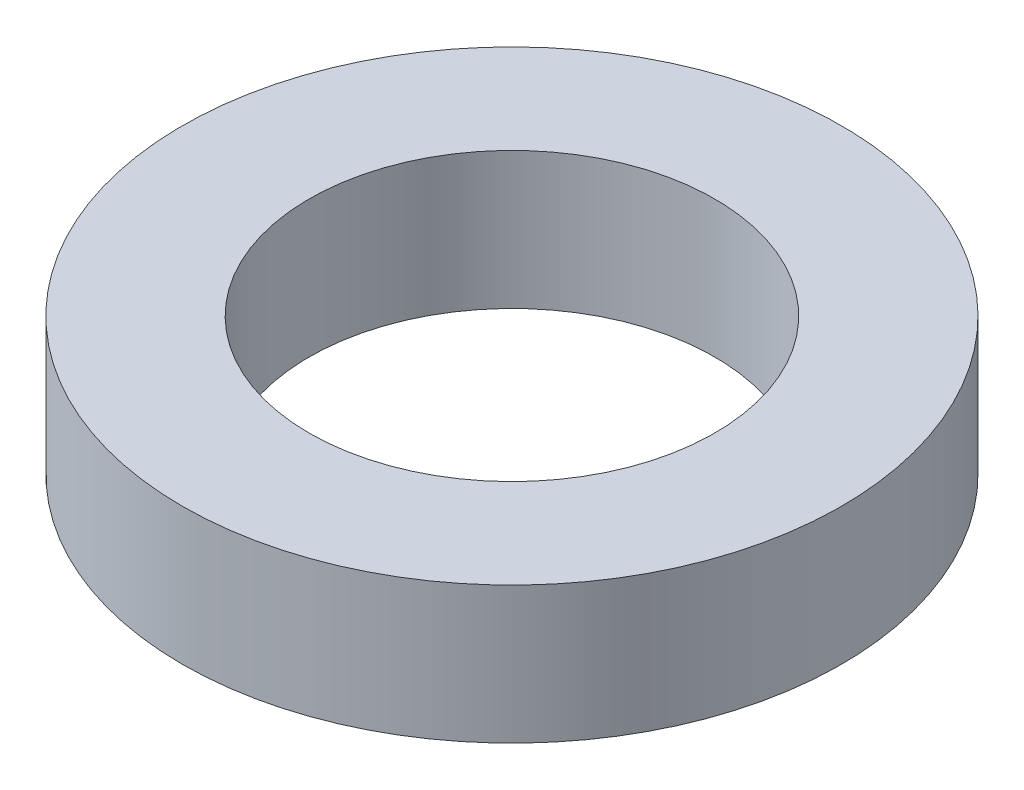
ISO-10303-21;
HEADER;
FILE_DESCRIPTION(('STEP AP214'),'2;1');
FILE_NAME('part.step','',(''),(''),'','','');
FILE_SCHEMA(('AUTOMOTIVE_DESIGN { 1 0 10303 214 1 1 1 1 }'));
ENDSEC;
DATA;
#1=APPLICATION_CONTEXT('core data for automotive mechanical design processes');
#2=APPLICATION_PROTOCOL_DEFINITION('international standard','automotive_design',2000,#1);
#3=PRODUCT_CONTEXT('',#1,'mechanical');
#4=PRODUCT('Part','Part','',(#3));
#5=PRODUCT_RELATED_PRODUCT_CATEGORY('part','',(#4));
#6=PRODUCT_DEFINITION_FORMATION('','',#4);
#7=PRODUCT_DEFINITION_CONTEXT('part definition',#1,'design');
#8=PRODUCT_DEFINITION('design','',#6,#7);
#9=PRODUCT_DEFINITION_SHAPE('','',#8);
#10=(LENGTH_UNIT() NAMED_UNIT(*) SI_UNIT(.MILLI.,.METRE.));
#11=(NAMED_UNIT(*) PLANE_ANGLE_UNIT() SI_UNIT($,.RADIAN.));
#12=(NAMED_UNIT(*) SI_UNIT($,.STERADIAN.) SOLID_ANGLE_UNIT());
#13=UNCERTAINTY_MEASURE_WITH_UNIT(LENGTH_MEASURE(1.E-05),#10,'distance_accuracy_value','');
#14=(GEOMETRIC_REPRESENTATION_CONTEXT(3) GLOBAL_UNCERTAINTY_ASSIGNED_CONTEXT((#13)) GLOBAL_UNIT_ASSIGNED_CONTEXT((#10,
#11,#12)) REPRESENTATION_CONTEXT('',''));
#15=CARTESIAN_POINT('',(0.,0.,0.));
#16=DIRECTION('',(0.,0.,1.));
#17=DIRECTION('',(1.,0.,0.));
#18=AXIS2_PLACEMENT_3D('',#15,#16,#17);
#19=CARTESIAN_POINT('',(0.,27.,0.));
#20=DIRECTION('',(0.,-1.,0.));
#21=DIRECTION('',(0.,0.,-1.));
#22=AXIS2_PLACEMENT_3D('',#19,#20,#21);
#23=CYLINDRICAL_SURFACE('',#22,65.);
#24=CARTESIAN_POINT('',(0.,27.,0.));
#25=DIRECTION('',(0.,1.,0.));
#26=DIRECTION('',(0.,0.,1.));
#27=AXIS2_PLACEMENT_3D('',#24,#25,#26);
#28=CIRCLE('',#27,65.);
#29=CARTESIAN_POINT('',(0.,27.,65.));
#30=VERTEX_POINT('',#29);
#31=EDGE_CURVE('E10',#30,#30,#28,.T.);
#32=ORIENTED_EDGE('',*,*,#31,.F.);
#33=EDGE_LOOP('',(#32));
#34=FACE_BOUND('',#33,.T.);
#35=CARTESIAN_POINT('',(0.,0.,0.));
#36=DIRECTION('',(0.,1.,0.));
#37=DIRECTION('',(0.,0.,1.));
#38=AXIS2_PLACEMENT_3D('',#35,#36,#37);
#39=CIRCLE('',#38,65.);
#40=CARTESIAN_POINT('',(0.,0.,65.));
#41=VERTEX_POINT('',#40);
#42=EDGE_CURVE('E37',#41,#41,#39,.T.);
#43=ORIENTED_EDGE('',*,*,#42,.T.);
#44=EDGE_LOOP('',(#43));
#45=FACE_BOUND('',#44,.T.);
#46=ADVANCED_FACE('F40',(#34,#45),#23,.T.);
#47=CARTESIAN_POINT('',(0.,27.,0.));
#48=DIRECTION('',(0.,1.,0.));
#49=DIRECTION('',(0.,0.,1.));
#50=AXIS2_PLACEMENT_3D('',#47,#48,#49);
#51=PLANE('',#50);
#52=CARTESIAN_POINT('',(0.,27.,0.));
#53=DIRECTION('',(0.,1.,0.));
#54=DIRECTION('',(0.,0.,1.));
#55=AXIS2_PLACEMENT_3D('',#52,#53,#54);
#56=CIRCLE('',#55,40.);
#57=CARTESIAN_POINT('',(0.,27.,40.));
#58=VERTEX_POINT('',#57);
#59=EDGE_CURVE('E50',#58,#58,#56,.T.);
#60=ORIENTED_EDGE('',*,*,#59,.F.);
#61=EDGE_LOOP('',(#60));
#62=FACE_BOUND('',#61,.T.);
#63=ORIENTED_EDGE('',*,*,#31,.T.);
#64=EDGE_LOOP('',(#63));
#65=FACE_BOUND('',#64,.T.);
#66=ADVANCED_FACE('F59',(#62,#65),#51,.T.);
#67=CARTESIAN_POINT('',(0.,0.,0.));
#68=DIRECTION('',(0.,1.,0.));
#69=DIRECTION('',(0.,0.,1.));
#70=AXIS2_PLACEMENT_3D('',#67,#68,#69);
#71=PLANE('',#70);
#72=CARTESIAN_POINT('',(0.,0.,0.));
#73=DIRECTION('',(0.,1.,0.));
#74=DIRECTION('',(0.,0.,1.));
#75=AXIS2_PLACEMENT_3D('',#72,#73,#74);
#76=CIRCLE('',#75,40.);
#77=CARTESIAN_POINT('',(0.,0.,40.));
#78=VERTEX_POINT('',#77);
#79=EDGE_CURVE('E47',#78,#78,#76,.T.);
#80=ORIENTED_EDGE('',*,*,#79,.T.);
#81=EDGE_LOOP('',(#80));
#82=FACE_BOUND('',#81,.T.);
#83=ORIENTED_EDGE('',*,*,#42,.F.);
#84=EDGE_LOOP('',(#83));
#85=FACE_BOUND('',#84,.T.);
#86=ADVANCED_FACE('F58',(#82,#85),#71,.F.);
#87=CARTESIAN_POINT('',(0.,27.,0.));
#88=DIRECTION('',(0.,-1.,0.));
#89=DIRECTION('',(0.,0.,-1.));
#90=AXIS2_PLACEMENT_3D('',#87,#88,#89);
#91=CYLINDRICAL_SURFACE('',#90,40.);
#92=ORIENTED_EDGE('',*,*,#59,.T.);
#93=EDGE_LOOP('',(#92));
#94=FACE_BOUND('',#93,.T.);
#95=ORIENTED_EDGE('',*,*,#79,.F.);
#96=EDGE_LOOP('',(#95));
#97=FACE_BOUND('',#96,.T.);
#98=ADVANCED_FACE('F54',(#94,#97),#91,.F.);
#99=CLOSED_SHELL('',(#46,#66,#86,#98));
#100=MANIFOLD_SOLID_BREP('B2',#99);
#101=ADVANCED_BREP_SHAPE_REPRESENTATION('',(#18,#100),#14);
#102=SHAPE_DEFINITION_REPRESENTATION(#9,#101);
ENDSEC;
END-ISO-10303-21;
